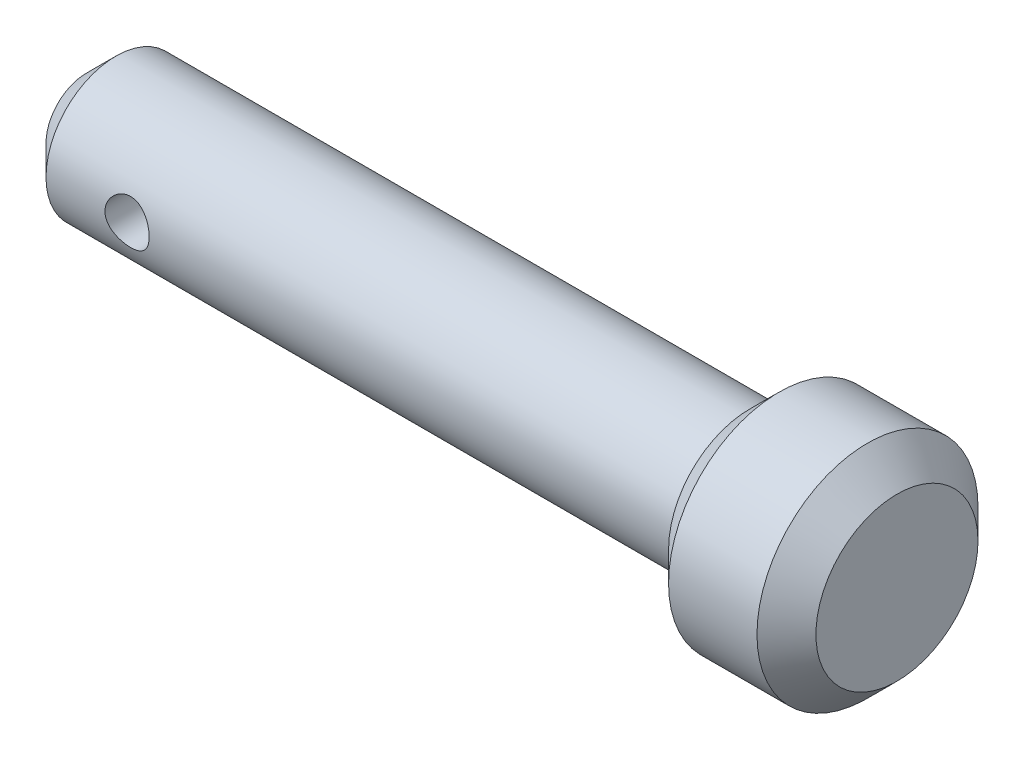
ISO-10303-21;
HEADER;
FILE_DESCRIPTION(('STEP AP214'),'2;1');
FILE_NAME('part.step','',(''),(''),'','','');
FILE_SCHEMA(('AUTOMOTIVE_DESIGN { 1 0 10303 214 1 1 1 1 }'));
ENDSEC;
DATA;
#1=APPLICATION_CONTEXT('core data for automotive mechanical design processes');
#2=APPLICATION_PROTOCOL_DEFINITION('international standard','automotive_design',2000,#1);
#3=PRODUCT_CONTEXT('',#1,'mechanical');
#4=PRODUCT('Part','Part','',(#3));
#5=PRODUCT_RELATED_PRODUCT_CATEGORY('part','',(#4));
#6=PRODUCT_DEFINITION_FORMATION('','',#4);
#7=PRODUCT_DEFINITION_CONTEXT('part definition',#1,'design');
#8=PRODUCT_DEFINITION('design','',#6,#7);
#9=PRODUCT_DEFINITION_SHAPE('','',#8);
#10=(LENGTH_UNIT() NAMED_UNIT(*) SI_UNIT(.MILLI.,.METRE.));
#11=(NAMED_UNIT(*) PLANE_ANGLE_UNIT() SI_UNIT($,.RADIAN.));
#12=(NAMED_UNIT(*) SI_UNIT($,.STERADIAN.) SOLID_ANGLE_UNIT());
#13=UNCERTAINTY_MEASURE_WITH_UNIT(LENGTH_MEASURE(1.E-05),#10,'distance_accuracy_value','');
#14=(GEOMETRIC_REPRESENTATION_CONTEXT(3) GLOBAL_UNCERTAINTY_ASSIGNED_CONTEXT((#13)) GLOBAL_UNIT_ASSIGNED_CONTEXT((#10,
#11,#12)) REPRESENTATION_CONTEXT('',''));
#15=CARTESIAN_POINT('',(0.,0.,0.));
#16=DIRECTION('',(0.,0.,1.));
#17=DIRECTION('',(1.,0.,0.));
#18=AXIS2_PLACEMENT_3D('',#15,#16,#17);
#19=CARTESIAN_POINT('',(110.,0.,0.));
#20=DIRECTION('',(1.,0.,0.));
#21=DIRECTION('',(0.,0.,-1.));
#22=AXIS2_PLACEMENT_3D('',#19,#20,#21);
#23=PLANE('',#22);
#24=CARTESIAN_POINT('',(110.,0.,0.));
#25=DIRECTION('',(1.,0.,0.));
#26=DIRECTION('',(0.,0.,-1.));
#27=AXIS2_PLACEMENT_3D('',#24,#25,#26);
#28=CIRCLE('',#27,10.9999999999999);
#29=CARTESIAN_POINT('',(110.,0.,-10.9999999999999));
#30=VERTEX_POINT('',#29);
#31=EDGE_CURVE('E10',#30,#30,#28,.T.);
#32=ORIENTED_EDGE('',*,*,#31,.T.);
#33=EDGE_LOOP('',(#32));
#34=FACE_BOUND('',#33,.T.);
#35=ADVANCED_FACE('F35',(#34),#23,.T.);
#36=CARTESIAN_POINT('',(0.,0.,0.));
#37=DIRECTION('',(-1.,0.,0.));
#38=DIRECTION('',(0.,0.,1.));
#39=AXIS2_PLACEMENT_3D('',#36,#37,#38);
#40=CYLINDRICAL_SURFACE('',#39,15.);
#41=CARTESIAN_POINT('',(94.,0.,0.));
#42=DIRECTION('',(-1.,0.,0.));
#43=DIRECTION('',(0.,0.,1.));
#44=AXIS2_PLACEMENT_3D('',#41,#42,#43);
#45=CIRCLE('',#44,15.);
#46=CARTESIAN_POINT('',(94.,0.,15.));
#47=VERTEX_POINT('',#46);
#48=EDGE_CURVE('E47',#47,#47,#45,.F.);
#49=ORIENTED_EDGE('',*,*,#48,.T.);
#50=EDGE_LOOP('',(#49));
#51=FACE_BOUND('',#50,.T.);
#52=CARTESIAN_POINT('',(106.,0.,0.));
#53=DIRECTION('',(1.,0.,0.));
#54=DIRECTION('',(0.,0.,-1.));
#55=AXIS2_PLACEMENT_3D('',#52,#53,#54);
#56=CIRCLE('',#55,15.);
#57=CARTESIAN_POINT('',(106.,0.,-15.));
#58=VERTEX_POINT('',#57);
#59=EDGE_CURVE('E52',#58,#58,#56,.F.);
#60=ORIENTED_EDGE('',*,*,#59,.T.);
#61=EDGE_LOOP('',(#60));
#62=FACE_BOUND('',#61,.T.);
#63=ADVANCED_FACE('F83',(#51,#62),#40,.T.);
#64=CARTESIAN_POINT('',(90.,-9.5,0.));
#65=DIRECTION('',(-1.,0.,0.));
#66=DIRECTION('',(0.,0.,1.));
#67=AXIS2_PLACEMENT_3D('',#64,#65,#66);
#68=PLANE('',#67);
#69=CARTESIAN_POINT('',(90.,0.,0.));
#70=DIRECTION('',(-1.,0.,0.));
#71=DIRECTION('',(0.,0.,1.));
#72=AXIS2_PLACEMENT_3D('',#69,#70,#71);
#73=CIRCLE('',#72,11.);
#74=CARTESIAN_POINT('',(90.,0.,11.));
#75=VERTEX_POINT('',#74);
#76=EDGE_CURVE('E100',#75,#75,#73,.T.);
#77=ORIENTED_EDGE('',*,*,#76,.T.);
#78=EDGE_LOOP('',(#77));
#79=FACE_BOUND('',#78,.T.);
#80=CARTESIAN_POINT('',(90.,0.,0.));
#81=DIRECTION('',(-1.,0.,0.));
#82=DIRECTION('',(0.,0.,1.));
#83=AXIS2_PLACEMENT_3D('',#80,#81,#82);
#84=CIRCLE('',#83,9.5);
#85=CARTESIAN_POINT('',(90.,0.,9.5));
#86=VERTEX_POINT('',#85);
#87=EDGE_CURVE('E110',#86,#86,#84,.T.);
#88=ORIENTED_EDGE('',*,*,#87,.F.);
#89=EDGE_LOOP('',(#88));
#90=FACE_BOUND('',#89,.T.);
#91=ADVANCED_FACE('F79',(#79,#90),#68,.T.);
#92=CARTESIAN_POINT('',(0.,0.,0.));
#93=DIRECTION('',(-1.,0.,0.));
#94=DIRECTION('',(0.,0.,1.));
#95=AXIS2_PLACEMENT_3D('',#92,#93,#94);
#96=CYLINDRICAL_SURFACE('',#95,9.5);
#97=CARTESIAN_POINT('',(18.,0.,9.5));
#98=CARTESIAN_POINT('',(17.9999991920058,0.164167089462809,9.49999935809229));
#99=CARTESIAN_POINT('',(17.9864802610108,0.328342993003654,9.49570457873447));
#100=CARTESIAN_POINT('',(17.9329071015536,0.651888233262994,9.47899296182888));
#101=CARTESIAN_POINT('',(17.8928473750455,0.811256566918245,9.46657444141808));
#102=CARTESIAN_POINT('',(17.787682087632,1.12047453900869,9.43497086374047));
#103=CARTESIAN_POINT('',(17.7226157777861,1.2703386681819,9.4157964146812));
#104=CARTESIAN_POINT('',(17.5694529271426,1.55702915841443,9.37265725199131));
#105=CARTESIAN_POINT('',(17.4813526103231,1.69385337678599,9.34869175310374));
#106=CARTESIAN_POINT('',(17.2817053251472,1.954886157509,9.29766753324294));
#107=CARTESIAN_POINT('',(17.1695643025264,2.07862693177764,9.27054036694509));
#108=CARTESIAN_POINT('',(16.9262834397545,2.30589485227851,9.21664353803552));
#109=CARTESIAN_POINT('',(16.7951399755812,2.4094181339002,9.1898739446838));
#110=CARTESIAN_POINT('',(16.5135024357682,2.59586933707154,9.1389859370637));
#111=CARTESIAN_POINT('',(16.3626023931117,2.67820924038344,9.11495183979177));
#112=CARTESIAN_POINT('',(16.0482150764475,2.81614778654471,9.07328724171044));
#113=CARTESIAN_POINT('',(15.8847312119093,2.87175364335561,9.05565501372426));
#114=CARTESIAN_POINT('',(15.5551021952611,2.9529272821257,9.02950721227384));
#115=CARTESIAN_POINT('',(15.3891925311824,2.97936420548708,9.02072856266505));
#116=CARTESIAN_POINT('',(15.0550782035603,3.00416514791963,9.01250122204869));
#117=CARTESIAN_POINT('',(14.8868741774869,3.00253681210414,9.01304999020652));
#118=CARTESIAN_POINT('',(14.5601689623222,2.97193247609429,9.02318352274045));
#119=CARTESIAN_POINT('',(14.4015505675183,2.94406576248244,9.03240174793261));
#120=CARTESIAN_POINT('',(14.0913669451148,2.86357596011184,9.05823941484151));
#121=CARTESIAN_POINT('',(13.9398024835499,2.81095018945964,9.07485965833217));
#122=CARTESIAN_POINT('',(13.6454054642487,2.68166168169205,9.11390651918068));
#123=CARTESIAN_POINT('',(13.5027359536904,2.60465367716268,9.13641567799888));
#124=CARTESIAN_POINT('',(13.2319823513009,2.4290264338323,9.1846668373259));
#125=CARTESIAN_POINT('',(13.103902128931,2.33040148183895,9.21040969170622));
#126=CARTESIAN_POINT('',(12.859697277003,2.10891443526093,9.26369376405774));
#127=CARTESIAN_POINT('',(12.7444065418517,1.98513792318251,9.29126291800172));
#128=CARTESIAN_POINT('',(12.5360135194598,1.71966506786238,9.34403785217591));
#129=CARTESIAN_POINT('',(12.4429129463112,1.57796734157916,9.36924344974064));
#130=CARTESIAN_POINT('',(12.2809619110504,1.27904248860848,9.41472566771743));
#131=CARTESIAN_POINT('',(12.2123141079512,1.12169880645912,9.43496068381886));
#132=CARTESIAN_POINT('',(12.1027104443961,0.796908546050009,9.46792126212738));
#133=CARTESIAN_POINT('',(12.0617459900205,0.629465120716915,9.48064915466278));
#134=CARTESIAN_POINT('',(12.0101010817217,0.296303884002125,9.49678470779038));
#135=CARTESIAN_POINT('',(11.9982920683953,0.130777575905981,9.50053950796354));
#136=CARTESIAN_POINT('',(12.0021062348327,-0.19991137896084,9.49933471585785));
#137=CARTESIAN_POINT('',(12.017725312924,-0.365074076408764,9.49437642655838));
#138=CARTESIAN_POINT('',(12.0750481797681,-0.685969212904211,9.47653086922814));
#139=CARTESIAN_POINT('',(12.1160771825588,-0.841834706561391,9.46384885282509));
#140=CARTESIAN_POINT('',(12.2222287462728,-1.14442314350254,9.43204434547225));
#141=CARTESIAN_POINT('',(12.2873543010944,-1.29114494807249,9.41292105424677));
#142=CARTESIAN_POINT('',(12.4416461801274,-1.57531276244697,9.36960895031318));
#143=CARTESIAN_POINT('',(12.5313665141461,-1.71244019799074,9.34530669896614));
#144=CARTESIAN_POINT('',(12.7316386422521,-1.97006979650918,9.29441218727718));
#145=CARTESIAN_POINT('',(12.8421961990815,-2.09056734431474,9.26781929454284));
#146=CARTESIAN_POINT('',(13.0863131934853,-2.31658675579943,9.21398298633844));
#147=CARTESIAN_POINT('',(13.2206231211429,-2.42130400734893,9.186756871098));
#148=CARTESIAN_POINT('',(13.5055000770868,-2.60679013327421,9.1358594627064));
#149=CARTESIAN_POINT('',(13.6560668993592,-2.68755931108112,9.11218812451676));
#150=CARTESIAN_POINT('',(13.9689238977613,-2.8223709751743,9.07133925816319));
#151=CARTESIAN_POINT('',(14.1311690538485,-2.87651039405967,9.05413823262217));
#152=CARTESIAN_POINT('',(14.4631296002453,-2.95649944180757,9.0283393693878));
#153=CARTESIAN_POINT('',(14.6328420427762,-2.98236013155669,9.01973816808891));
#154=CARTESIAN_POINT('',(14.9664938518604,-3.00425241211469,9.01246833575292));
#155=CARTESIAN_POINT('',(15.1303379199969,-3.00160628169283,9.01335938768914));
#156=CARTESIAN_POINT('',(15.4551233157725,-2.96976166390158,9.02390107112083));
#157=CARTESIAN_POINT('',(15.6160647838582,-2.94056446477842,9.0335512776259));
#158=CARTESIAN_POINT('',(15.928056941565,-2.8573397985787,9.06021304876319));
#159=CARTESIAN_POINT('',(16.0792211455767,-2.80369834624608,9.07710994083738));
#160=CARTESIAN_POINT('',(16.3705239915776,-2.67341300631294,9.11632984499268));
#161=CARTESIAN_POINT('',(16.5106603495449,-2.59676436934434,9.13865397723677));
#162=CARTESIAN_POINT('',(16.7819734905951,-2.4190708026092,9.18732235584319));
#163=CARTESIAN_POINT('',(16.9125710165368,-2.31717569257864,9.21379131671488));
#164=CARTESIAN_POINT('',(17.1552416752614,-2.0933684813078,9.26720162412937));
#165=CARTESIAN_POINT('',(17.2673097948543,-1.97145098067163,9.29414309633804));
#166=CARTESIAN_POINT('',(17.4735138486102,-1.7061326528479,9.34654886057908));
#167=CARTESIAN_POINT('',(17.5669207814593,-1.56214764703045,9.37193310874742));
#168=CARTESIAN_POINT('',(17.728083368742,-1.25971894568572,9.41734758486009));
#169=CARTESIAN_POINT('',(17.7958485792692,-1.10128066394409,9.43737980656471));
#170=CARTESIAN_POINT('',(17.8991975382065,-0.787271829955634,9.468532861615));
#171=CARTESIAN_POINT('',(17.9368877591712,-0.632450266372878,9.48022921021867));
#172=CARTESIAN_POINT('',(17.9872867253289,-0.318421271901134,9.49596227615521));
#173=CARTESIAN_POINT('',(18.00000078362,-0.15921478111217,9.50000062254375));
#174=CARTESIAN_POINT('',(18.,0.,9.5));
#175=B_SPLINE_CURVE_WITH_KNOTS('',3,(#97,#98,#99,#100,#101,#102,#103,#104,#105,#106,#107,#108,
#109,#110,#111,#112,#113,#114,#115,#116,#117,#118,#119,#120,#121,#122,#123,#124,#125,#126,#127,
#128,#129,#130,#131,#132,#133,#134,#135,#136,#137,#138,#139,#140,#141,#142,#143,#144,#145,#146,
#147,#148,#149,#150,#151,#152,#153,#154,#155,#156,#157,#158,#159,#160,#161,#162,#163,#164,#165,
#166,#167,#168,#169,#170,#171,#172,#173,#174),.UNSPECIFIED.,.T.,.F.,(4,2,2,2,2,2,2,2,2,2,2,2,2,
2,2,2,2,2,2,2,2,2,2,2,2,2,2,2,2,2,2,2,2,2,2,2,2,2,4),(0.,0.491915941705381,0.983933817902441,
1.47518254201799,1.9665118483056,2.47177433217168,2.97713330355079,3.49529138086525,
4.0133095589189,4.51543663249028,5.01742692636232,5.4991042363361,5.98083373346493,
6.46971527661729,6.95872618352227,7.47049694812962,7.98230723196769,8.49826565849845,
9.01406383907483,9.50955937080917,10.0049808110835,10.487778781206,10.9706367571643,
11.4654198237929,11.9603399289468,12.4753133176055,12.9902801810782,13.5033584262729,
14.0162359151874,14.5054301927744,14.9946007361353,15.4763007218674,15.9581002132873,
16.4590917155026,16.9602185415511,17.4781824310863,17.9959530965539,18.4731312898967,
18.9502079636715),.UNSPECIFIED.);
#176=CARTESIAN_POINT('',(18.,0.,9.5));
#177=VERTEX_POINT('',#176);
#178=EDGE_CURVE('E39',#177,#177,#175,.T.);
#179=ORIENTED_EDGE('',*,*,#178,.F.);
#180=EDGE_LOOP('',(#179));
#181=FACE_BOUND('',#180,.T.);
#182=CARTESIAN_POINT('',(18.,0.,-9.5));
#183=CARTESIAN_POINT('',(17.9999991920058,-0.164167089462809,-9.49999935809229));
#184=CARTESIAN_POINT('',(17.9864802610108,-0.328342993003654,-9.49570457873447));
#185=CARTESIAN_POINT('',(17.9329071015536,-0.651888233262994,-9.47899296182888));
#186=CARTESIAN_POINT('',(17.8928473750455,-0.811256566918245,-9.46657444141808));
#187=CARTESIAN_POINT('',(17.787682087632,-1.12047453900869,-9.43497086374047));
#188=CARTESIAN_POINT('',(17.7226157777861,-1.2703386681819,-9.4157964146812));
#189=CARTESIAN_POINT('',(17.5694529271426,-1.55702915841443,-9.37265725199131));
#190=CARTESIAN_POINT('',(17.4813526103231,-1.69385337678599,-9.34869175310374));
#191=CARTESIAN_POINT('',(17.2817053251472,-1.954886157509,-9.29766753324294));
#192=CARTESIAN_POINT('',(17.1695643025264,-2.07862693177764,-9.27054036694509));
#193=CARTESIAN_POINT('',(16.9262834397545,-2.30589485227851,-9.21664353803552));
#194=CARTESIAN_POINT('',(16.7951399755812,-2.4094181339002,-9.1898739446838));
#195=CARTESIAN_POINT('',(16.5135024357682,-2.59586933707154,-9.1389859370637));
#196=CARTESIAN_POINT('',(16.3626023931117,-2.67820924038344,-9.11495183979177));
#197=CARTESIAN_POINT('',(16.0482150764475,-2.81614778654471,-9.07328724171044));
#198=CARTESIAN_POINT('',(15.8847312119093,-2.87175364335561,-9.05565501372426));
#199=CARTESIAN_POINT('',(15.5551021952611,-2.9529272821257,-9.02950721227384));
#200=CARTESIAN_POINT('',(15.3891925311824,-2.97936420548708,-9.02072856266505));
#201=CARTESIAN_POINT('',(15.0550782035603,-3.00416514791963,-9.01250122204869));
#202=CARTESIAN_POINT('',(14.8868741774869,-3.00253681210414,-9.01304999020652));
#203=CARTESIAN_POINT('',(14.5601689623222,-2.97193247609429,-9.02318352274045));
#204=CARTESIAN_POINT('',(14.4015505675183,-2.94406576248244,-9.03240174793261));
#205=CARTESIAN_POINT('',(14.0913669451148,-2.86357596011184,-9.05823941484151));
#206=CARTESIAN_POINT('',(13.9398024835499,-2.81095018945964,-9.07485965833217));
#207=CARTESIAN_POINT('',(13.6454054642487,-2.68166168169205,-9.11390651918068));
#208=CARTESIAN_POINT('',(13.5027359536904,-2.60465367716268,-9.13641567799888));
#209=CARTESIAN_POINT('',(13.2319823513009,-2.4290264338323,-9.1846668373259));
#210=CARTESIAN_POINT('',(13.103902128931,-2.33040148183895,-9.21040969170622));
#211=CARTESIAN_POINT('',(12.859697277003,-2.10891443526093,-9.26369376405774));
#212=CARTESIAN_POINT('',(12.7444065418517,-1.98513792318251,-9.29126291800172));
#213=CARTESIAN_POINT('',(12.5360135194598,-1.71966506786238,-9.34403785217591));
#214=CARTESIAN_POINT('',(12.4429129463112,-1.57796734157916,-9.36924344974064));
#215=CARTESIAN_POINT('',(12.2809619110504,-1.27904248860848,-9.41472566771743));
#216=CARTESIAN_POINT('',(12.2123141079512,-1.12169880645912,-9.43496068381886));
#217=CARTESIAN_POINT('',(12.1027104443961,-0.796908546050009,-9.46792126212738));
#218=CARTESIAN_POINT('',(12.0617459900205,-0.629465120716915,-9.48064915466278));
#219=CARTESIAN_POINT('',(12.0101010817217,-0.296303884002125,-9.49678470779038));
#220=CARTESIAN_POINT('',(11.9982920683953,-0.130777575905981,-9.50053950796354));
#221=CARTESIAN_POINT('',(12.0021062348327,0.19991137896084,-9.49933471585785));
#222=CARTESIAN_POINT('',(12.017725312924,0.365074076408764,-9.49437642655838));
#223=CARTESIAN_POINT('',(12.0750481797681,0.685969212904211,-9.47653086922814));
#224=CARTESIAN_POINT('',(12.1160771825588,0.841834706561391,-9.46384885282509));
#225=CARTESIAN_POINT('',(12.2222287462728,1.14442314350254,-9.43204434547225));
#226=CARTESIAN_POINT('',(12.2873543010944,1.29114494807249,-9.41292105424677));
#227=CARTESIAN_POINT('',(12.4416461801274,1.57531276244697,-9.36960895031318));
#228=CARTESIAN_POINT('',(12.5313665141461,1.71244019799074,-9.34530669896614));
#229=CARTESIAN_POINT('',(12.7316386422521,1.97006979650918,-9.29441218727718));
#230=CARTESIAN_POINT('',(12.8421961990815,2.09056734431474,-9.26781929454284));
#231=CARTESIAN_POINT('',(13.0863131934853,2.31658675579943,-9.21398298633844));
#232=CARTESIAN_POINT('',(13.2206231211429,2.42130400734893,-9.186756871098));
#233=CARTESIAN_POINT('',(13.5055000770868,2.60679013327421,-9.1358594627064));
#234=CARTESIAN_POINT('',(13.6560668993592,2.68755931108112,-9.11218812451676));
#235=CARTESIAN_POINT('',(13.9689238977613,2.8223709751743,-9.07133925816319));
#236=CARTESIAN_POINT('',(14.1311690538485,2.87651039405967,-9.05413823262217));
#237=CARTESIAN_POINT('',(14.4631296002453,2.95649944180757,-9.0283393693878));
#238=CARTESIAN_POINT('',(14.6328420427762,2.98236013155669,-9.01973816808891));
#239=CARTESIAN_POINT('',(14.9664938518604,3.00425241211469,-9.01246833575292));
#240=CARTESIAN_POINT('',(15.1303379199969,3.00160628169283,-9.01335938768914));
#241=CARTESIAN_POINT('',(15.4551233157725,2.96976166390158,-9.02390107112083));
#242=CARTESIAN_POINT('',(15.6160647838582,2.94056446477842,-9.0335512776259));
#243=CARTESIAN_POINT('',(15.928056941565,2.8573397985787,-9.06021304876319));
#244=CARTESIAN_POINT('',(16.0792211455767,2.80369834624608,-9.07710994083738));
#245=CARTESIAN_POINT('',(16.3705239915776,2.67341300631294,-9.11632984499268));
#246=CARTESIAN_POINT('',(16.5106603495449,2.59676436934434,-9.13865397723677));
#247=CARTESIAN_POINT('',(16.7819734905951,2.4190708026092,-9.18732235584319));
#248=CARTESIAN_POINT('',(16.9125710165368,2.31717569257864,-9.21379131671488));
#249=CARTESIAN_POINT('',(17.1552416752614,2.0933684813078,-9.26720162412937));
#250=CARTESIAN_POINT('',(17.2673097948543,1.97145098067163,-9.29414309633804));
#251=CARTESIAN_POINT('',(17.4735138486102,1.7061326528479,-9.34654886057908));
#252=CARTESIAN_POINT('',(17.5669207814593,1.56214764703045,-9.37193310874742));
#253=CARTESIAN_POINT('',(17.728083368742,1.25971894568572,-9.41734758486009));
#254=CARTESIAN_POINT('',(17.7958485792692,1.10128066394409,-9.43737980656471));
#255=CARTESIAN_POINT('',(17.8991975382065,0.787271829955634,-9.468532861615));
#256=CARTESIAN_POINT('',(17.9368877591712,0.632450266372878,-9.48022921021867));
#257=CARTESIAN_POINT('',(17.9872867253289,0.318421271901134,-9.49596227615521));
#258=CARTESIAN_POINT('',(18.00000078362,0.15921478111217,-9.50000062254375));
#259=CARTESIAN_POINT('',(18.,0.,-9.5));
#260=B_SPLINE_CURVE_WITH_KNOTS('',3,(#182,#183,#184,#185,#186,#187,#188,#189,#190,#191,#192,
#193,#194,#195,#196,#197,#198,#199,#200,#201,#202,#203,#204,#205,#206,#207,#208,#209,#210,#211,
#212,#213,#214,#215,#216,#217,#218,#219,#220,#221,#222,#223,#224,#225,#226,#227,#228,#229,#230,
#231,#232,#233,#234,#235,#236,#237,#238,#239,#240,#241,#242,#243,#244,#245,#246,#247,#248,#249,
#250,#251,#252,#253,#254,#255,#256,#257,#258,#259),.UNSPECIFIED.,.T.,.F.,(4,2,2,2,2,2,2,2,2,2,2,
2,2,2,2,2,2,2,2,2,2,2,2,2,2,2,2,2,2,2,2,2,2,2,2,2,2,2,4),(0.,0.491915941705381,
0.983933817902441,1.47518254201799,1.9665118483056,2.47177433217168,2.97713330355079,
3.49529138086525,4.0133095589189,4.51543663249028,5.01742692636232,5.4991042363361,
5.98083373346493,6.46971527661729,6.95872618352227,7.47049694812962,7.98230723196769,
8.49826565849845,9.01406383907483,9.50955937080917,10.0049808110835,10.487778781206,
10.9706367571643,11.4654198237929,11.9603399289468,12.4753133176055,12.9902801810782,
13.5033584262729,14.0162359151874,14.5054301927744,14.9946007361353,15.4763007218674,
15.9581002132873,16.4590917155026,16.9602185415511,17.4781824310863,17.9959530965539,
18.4731312898967,18.9502079636715),.UNSPECIFIED.);
#261=CARTESIAN_POINT('',(18.,0.,-9.5));
#262=VERTEX_POINT('',#261);
#263=EDGE_CURVE('E55',#262,#262,#260,.T.);
#264=ORIENTED_EDGE('',*,*,#263,.F.);
#265=EDGE_LOOP('',(#264));
#266=FACE_BOUND('',#265,.T.);
#267=CARTESIAN_POINT('',(4.00000000000006,0.,0.));
#268=DIRECTION('',(-1.,0.,0.));
#269=DIRECTION('',(0.,0.,1.));
#270=AXIS2_PLACEMENT_3D('',#267,#268,#269);
#271=CIRCLE('',#270,9.5);
#272=CARTESIAN_POINT('',(4.00000000000006,0.,9.5));
#273=VERTEX_POINT('',#272);
#274=EDGE_CURVE('E102',#273,#273,#271,.F.);
#275=ORIENTED_EDGE('',*,*,#274,.T.);
#276=EDGE_LOOP('',(#275));
#277=FACE_BOUND('',#276,.T.);
#278=ORIENTED_EDGE('',*,*,#87,.T.);
#279=EDGE_LOOP('',(#278));
#280=FACE_BOUND('',#279,.T.);
#281=ADVANCED_FACE('F59',(#181,#266,#277,#280),#96,.T.);
#282=CARTESIAN_POINT('',(0.,0.,0.));
#283=DIRECTION('',(-1.,0.,0.));
#284=DIRECTION('',(0.,0.,1.));
#285=AXIS2_PLACEMENT_3D('',#282,#283,#284);
#286=PLANE('',#285);
#287=CARTESIAN_POINT('',(0.,0.,0.));
#288=DIRECTION('',(-1.,0.,0.));
#289=DIRECTION('',(0.,0.,1.));
#290=AXIS2_PLACEMENT_3D('',#287,#288,#289);
#291=CIRCLE('',#290,5.49999999999996);
#292=CARTESIAN_POINT('',(0.,0.,5.49999999999996));
#293=VERTEX_POINT('',#292);
#294=EDGE_CURVE('E106',#293,#293,#291,.T.);
#295=ORIENTED_EDGE('',*,*,#294,.T.);
#296=EDGE_LOOP('',(#295));
#297=FACE_BOUND('',#296,.T.);
#298=ADVANCED_FACE('F67',(#297),#286,.T.);
#299=CARTESIAN_POINT('',(0.,0.,0.));
#300=DIRECTION('',(1.,0.,0.));
#301=DIRECTION('',(0.,0.,-1.));
#302=AXIS2_PLACEMENT_3D('',#299,#300,#301);
#303=CONICAL_SURFACE('',#302,5.49999999999996,0.785398163397446);
#304=ORIENTED_EDGE('',*,*,#274,.F.);
#305=EDGE_LOOP('',(#304));
#306=FACE_BOUND('',#305,.T.);
#307=ORIENTED_EDGE('',*,*,#294,.F.);
#308=EDGE_LOOP('',(#307));
#309=FACE_BOUND('',#308,.T.);
#310=ADVANCED_FACE('F70',(#306,#309),#303,.T.);
#311=CARTESIAN_POINT('',(90.,0.,0.));
#312=DIRECTION('',(1.,0.,0.));
#313=DIRECTION('',(0.,0.,-1.));
#314=AXIS2_PLACEMENT_3D('',#311,#312,#313);
#315=CONICAL_SURFACE('',#314,11.,0.785398163397445);
#316=ORIENTED_EDGE('',*,*,#48,.F.);
#317=EDGE_LOOP('',(#316));
#318=FACE_BOUND('',#317,.T.);
#319=ORIENTED_EDGE('',*,*,#76,.F.);
#320=EDGE_LOOP('',(#319));
#321=FACE_BOUND('',#320,.T.);
#322=ADVANCED_FACE('F76',(#318,#321),#315,.T.);
#323=CARTESIAN_POINT('',(106.,0.,0.));
#324=DIRECTION('',(-1.,0.,0.));
#325=DIRECTION('',(0.,0.,1.));
#326=AXIS2_PLACEMENT_3D('',#323,#324,#325);
#327=CONICAL_SURFACE('',#326,15.,0.785398163397452);
#328=ORIENTED_EDGE('',*,*,#31,.F.);
#329=EDGE_LOOP('',(#328));
#330=FACE_BOUND('',#329,.T.);
#331=ORIENTED_EDGE('',*,*,#59,.F.);
#332=EDGE_LOOP('',(#331));
#333=FACE_BOUND('',#332,.T.);
#334=ADVANCED_FACE('F37',(#330,#333),#327,.T.);
#335=CARTESIAN_POINT('',(15.,0.,-15.));
#336=DIRECTION('',(0.,0.,1.));
#337=DIRECTION('',(1.,0.,0.));
#338=AXIS2_PLACEMENT_3D('',#335,#336,#337);
#339=CYLINDRICAL_SURFACE('',#338,3.);
#340=ORIENTED_EDGE('',*,*,#178,.T.);
#341=EDGE_LOOP('',(#340));
#342=FACE_BOUND('',#341,.T.);
#343=ORIENTED_EDGE('',*,*,#263,.T.);
#344=EDGE_LOOP('',(#343));
#345=FACE_BOUND('',#344,.T.);
#346=ADVANCED_FACE('F63',(#342,#345),#339,.F.);
#347=CLOSED_SHELL('',(#35,#63,#91,#281,#298,#310,#322,#334,#346));
#348=MANIFOLD_SOLID_BREP('B2',#347);
#349=ADVANCED_BREP_SHAPE_REPRESENTATION('',(#18,#348),#14);
#350=SHAPE_DEFINITION_REPRESENTATION(#9,#349);
ENDSEC;
END-ISO-10303-21;
